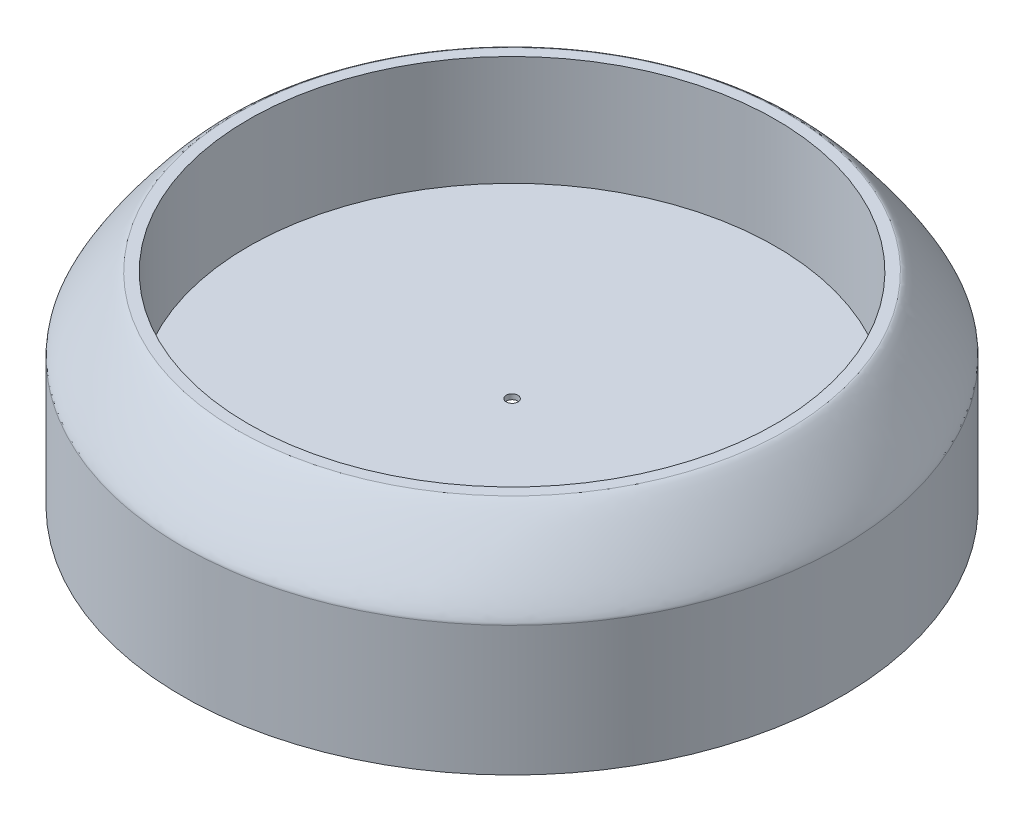
ISO-10303-21;
HEADER;
FILE_DESCRIPTION(('STEP AP214'),'2;1');
FILE_NAME('part.step','',(''),(''),'','','');
FILE_SCHEMA(('AUTOMOTIVE_DESIGN { 1 0 10303 214 1 1 1 1 }'));
ENDSEC;
DATA;
#1=APPLICATION_CONTEXT('core data for automotive mechanical design processes');
#2=APPLICATION_PROTOCOL_DEFINITION('international standard','automotive_design',2000,#1);
#3=PRODUCT_CONTEXT('',#1,'mechanical');
#4=PRODUCT('Part','Part','',(#3));
#5=PRODUCT_RELATED_PRODUCT_CATEGORY('part','',(#4));
#6=PRODUCT_DEFINITION_FORMATION('','',#4);
#7=PRODUCT_DEFINITION_CONTEXT('part definition',#1,'design');
#8=PRODUCT_DEFINITION('design','',#6,#7);
#9=PRODUCT_DEFINITION_SHAPE('','',#8);
#10=(LENGTH_UNIT() NAMED_UNIT(*) SI_UNIT(.MILLI.,.METRE.));
#11=(NAMED_UNIT(*) PLANE_ANGLE_UNIT() SI_UNIT($,.RADIAN.));
#12=(NAMED_UNIT(*) SI_UNIT($,.STERADIAN.) SOLID_ANGLE_UNIT());
#13=UNCERTAINTY_MEASURE_WITH_UNIT(LENGTH_MEASURE(1.E-05),#10,'distance_accuracy_value','');
#14=(GEOMETRIC_REPRESENTATION_CONTEXT(3) GLOBAL_UNCERTAINTY_ASSIGNED_CONTEXT((#13)) GLOBAL_UNIT_ASSIGNED_CONTEXT((#10,
#11,#12)) REPRESENTATION_CONTEXT('',''));
#15=CARTESIAN_POINT('',(0.,0.,0.));
#16=DIRECTION('',(0.,0.,1.));
#17=DIRECTION('',(1.,0.,0.));
#18=AXIS2_PLACEMENT_3D('',#15,#16,#17);
#19=CARTESIAN_POINT('',(0.,80.,0.));
#20=DIRECTION('',(0.,-1.,0.));
#21=DIRECTION('',(0.,0.,-1.));
#22=AXIS2_PLACEMENT_3D('',#19,#20,#21);
#23=CYLINDRICAL_SURFACE('',#22,90.);
#24=CARTESIAN_POINT('',(0.,60.,90.));
#25=CARTESIAN_POINT('',(11.7809724507595,60.,90.));
#26=CARTESIAN_POINT('',(23.5573095926304,60.,87.6575409000262));
#27=CARTESIAN_POINT('',(45.3257082330858,60.,78.6407749520055));
#28=CARTESIAN_POINT('',(55.3092047979656,60.,71.9700158156129));
#29=CARTESIAN_POINT('',(71.9700158156129,60.,55.3092047979656));
#30=CARTESIAN_POINT('',(78.640774952019,60.,45.3257082330533));
#31=CARTESIAN_POINT('',(87.6575409000127,60.,23.5573095926628));
#32=CARTESIAN_POINT('',(90.,60.,11.7809724506127));
#33=CARTESIAN_POINT('',(90.,60.,-11.7809724506127));
#34=CARTESIAN_POINT('',(87.6575409000227,60.,-23.5573095926388));
#35=CARTESIAN_POINT('',(78.6407749520089,60.,-45.3257082330774));
#36=CARTESIAN_POINT('',(71.9700158156117,60.,-55.3092047979669));
#37=CARTESIAN_POINT('',(55.3092047979668,60.,-71.9700158156117));
#38=CARTESIAN_POINT('',(45.3257082330825,60.,-78.6407749520068));
#39=CARTESIAN_POINT('',(23.5573095926339,60.,-87.6575409000247));
#40=CARTESIAN_POINT('',(11.7809724506127,60.,-90.));
#41=CARTESIAN_POINT('',(-11.7809724506126,60.,-90.));
#42=CARTESIAN_POINT('',(-23.5573095926336,60.,-87.6575409000248));
#43=CARTESIAN_POINT('',(-45.3257082330823,60.,-78.640774952007));
#44=CARTESIAN_POINT('',(-55.3092047979669,60.,-71.9700158156117));
#45=CARTESIAN_POINT('',(-71.9700158156117,60.,-55.3092047979668));
#46=CARTESIAN_POINT('',(-78.6407749520068,60.,-45.3257082330825));
#47=CARTESIAN_POINT('',(-87.6575409000247,60.,-23.5573095926339));
#48=CARTESIAN_POINT('',(-90.,60.,-11.7809724506125));
#49=CARTESIAN_POINT('',(-90.,60.,11.7809724506128));
#50=CARTESIAN_POINT('',(-87.6575409000127,60.,23.5573095926627));
#51=CARTESIAN_POINT('',(-78.640774952019,60.,45.3257082330532));
#52=CARTESIAN_POINT('',(-71.9700158156118,60.,55.3092047979667));
#53=CARTESIAN_POINT('',(-55.3092047979671,60.,71.9700158156115));
#54=CARTESIAN_POINT('',(-45.3257082330825,60.,78.6407749520068));
#55=CARTESIAN_POINT('',(-23.5573095926339,60.,87.6575409000247));
#56=CARTESIAN_POINT('',(-11.7809724507595,60.,90.));
#57=CARTESIAN_POINT('',(0.,60.,90.));
#58=(BOUNDED_CURVE() B_SPLINE_CURVE(3,(#24,#25,#26,#27,#28,#29,#30,#31,#32,#33,#34,#35,#36,#37,
#38,#39,#40,#41,#42,#43,#44,#45,#46,#47,#48,#49,#50,#51,#52,#53,#54,#55,#56,#57),.UNSPECIFIED.,
.T.,.F.) B_SPLINE_CURVE_WITH_KNOTS((4,2,2,2,2,2,2,2,2,2,2,2,2,2,2,2,4),(0.,0.392699081698724,
0.785398163397448,1.17809724509617,1.5707963267949,1.96349540849362,2.35619449019234,
2.74889357189107,3.14159265358979,3.53429173528852,3.92699081698724,4.31968989868597,
4.71238898038469,5.10508806208341,5.49778714378214,5.89048622548086,6.28318530717959),
.UNSPECIFIED.) CURVE() GEOMETRIC_REPRESENTATION_ITEM() RATIONAL_B_SPLINE_CURVE((1.,1.,1.,1.,1.,
1.,1.,1.,1.,1.,1.,1.,1.,1.,1.,1.,1.,1.,1.,1.,1.,1.,1.,1.,1.,1.,1.,1.,1.,1.,1.,1.,1.,1.)) REPRESENTATION_ITEM(''));
#59=CARTESIAN_POINT('',(0.,60.,90.));
#60=VERTEX_POINT('',#59);
#61=EDGE_CURVE('E12',#60,#60,#58,.F.);
#62=ORIENTED_EDGE('',*,*,#61,.T.);
#63=EDGE_LOOP('',(#62));
#64=FACE_BOUND('',#63,.T.);
#65=CARTESIAN_POINT('',(0.,24.6,0.));
#66=DIRECTION('',(0.,-1.,0.));
#67=DIRECTION('',(0.,0.,-1.));
#68=AXIS2_PLACEMENT_3D('',#65,#66,#67);
#69=CIRCLE('',#68,90.);
#70=CARTESIAN_POINT('',(0.,24.6,-90.));
#71=VERTEX_POINT('',#70);
#72=EDGE_CURVE('E103',#71,#71,#69,.T.);
#73=ORIENTED_EDGE('',*,*,#72,.F.);
#74=EDGE_LOOP('',(#73));
#75=FACE_BOUND('',#74,.T.);
#76=ADVANCED_FACE('F43',(#64,#75),#23,.T.);
#77=CARTESIAN_POINT('',(0.,80.,0.));
#78=DIRECTION('',(0.,1.,0.));
#79=DIRECTION('',(0.,0.,1.));
#80=AXIS2_PLACEMENT_3D('',#77,#78,#79);
#81=PLANE('',#80);
#82=CARTESIAN_POINT('',(0.,80.,75.));
#83=CARTESIAN_POINT('',(-9.81747704229956,80.,75.));
#84=CARTESIAN_POINT('',(-19.6310913271961,80.,73.0479507500439));
#85=CARTESIAN_POINT('',(-37.7714235275675,80.,65.533979126649));
#86=CARTESIAN_POINT('',(-46.0910039983286,80.,59.9750131796535));
#87=CARTESIAN_POINT('',(-59.9750131796538,80.,46.0910039983283));
#88=CARTESIAN_POINT('',(-65.5339791266491,80.,37.7714235275333));
#89=CARTESIAN_POINT('',(-73.047950750044,80.,19.63109132723));
#90=CARTESIAN_POINT('',(-75.,80.,9.81747704217735));
#91=CARTESIAN_POINT('',(-75.,80.,-9.81747704217711));
#92=CARTESIAN_POINT('',(-73.0479507500439,80.,-19.6310913272132));
#93=CARTESIAN_POINT('',(-65.533979126649,80.,-37.7714235275505));
#94=CARTESIAN_POINT('',(-59.9750131796537,80.,-46.0910039983284));
#95=CARTESIAN_POINT('',(-46.0910039983285,80.,-59.9750131796537));
#96=CARTESIAN_POINT('',(-37.7714235275503,80.,-65.5339791266491));
#97=CARTESIAN_POINT('',(-19.631091327213,80.,-73.047950750044));
#98=CARTESIAN_POINT('',(-9.81747704217721,80.,-75.));
#99=CARTESIAN_POINT('',(9.81747704217723,80.,-75.));
#100=CARTESIAN_POINT('',(19.6310913271961,80.,-73.0479507500439));
#101=CARTESIAN_POINT('',(37.7714235275675,80.,-65.533979126649));
#102=CARTESIAN_POINT('',(46.0910039983284,80.,-59.9750131796538));
#103=CARTESIAN_POINT('',(59.9750131796537,80.,-46.0910039983285));
#104=CARTESIAN_POINT('',(65.5339791266491,80.,-37.7714235275504));
#105=CARTESIAN_POINT('',(73.0479507500439,80.,-19.6310913272131));
#106=CARTESIAN_POINT('',(75.,80.,-9.81747704217721));
#107=CARTESIAN_POINT('',(75.,80.,9.81747704217722));
#108=CARTESIAN_POINT('',(73.0479507499759,80.,19.631091327213));
#109=CARTESIAN_POINT('',(65.5339791267172,80.,37.7714235275504));
#110=CARTESIAN_POINT('',(59.9750131796775,80.,46.0910039983047));
#111=CARTESIAN_POINT('',(46.0910039983047,80.,59.9750131796775));
#112=CARTESIAN_POINT('',(37.7714235275578,80.,65.5339791266178));
#113=CARTESIAN_POINT('',(19.6310913272057,80.,73.0479507500753));
#114=CARTESIAN_POINT('',(9.81747704229955,80.,75.));
#115=CARTESIAN_POINT('',(0.,80.,75.));
#116=(BOUNDED_CURVE() B_SPLINE_CURVE(3,(#82,#83,#84,#85,#86,#87,#88,#89,#90,#91,#92,#93,#94,#95,
#96,#97,#98,#99,#100,#101,#102,#103,#104,#105,#106,#107,#108,#109,#110,#111,#112,#113,#114,
#115),.UNSPECIFIED.,.T.,.F.) B_SPLINE_CURVE_WITH_KNOTS((4,2,2,2,2,2,2,2,2,2,2,2,2,2,2,2,4),(0.,
0.392699081698725,0.785398163397448,1.17809724509617,1.5707963267949,1.96349540849362,
2.35619449019234,2.74889357189107,3.14159265358979,3.53429173528852,3.92699081698724,
4.31968989868597,4.71238898038469,5.10508806208341,5.49778714378214,5.89048622548086,
6.28318530717959),
.UNSPECIFIED.) CURVE() GEOMETRIC_REPRESENTATION_ITEM() RATIONAL_B_SPLINE_CURVE((1.,1.,1.,1.,1.,
1.,1.,1.,1.,1.,1.,1.,1.,1.,1.,1.,1.,1.,1.,1.,1.,1.,1.,1.,1.,1.,1.,1.,1.,1.,1.,1.,1.,1.)) REPRESENTATION_ITEM(''));
#117=CARTESIAN_POINT('',(0.,80.,75.));
#118=VERTEX_POINT('',#117);
#119=EDGE_CURVE('E56',#118,#118,#116,.F.);
#120=ORIENTED_EDGE('',*,*,#119,.T.);
#121=EDGE_LOOP('',(#120));
#122=FACE_BOUND('',#121,.T.);
#123=CARTESIAN_POINT('',(0.,80.,0.));
#124=DIRECTION('',(0.,1.,0.));
#125=DIRECTION('',(0.,0.,1.));
#126=AXIS2_PLACEMENT_3D('',#123,#124,#125);
#127=CIRCLE('',#126,72.);
#128=CARTESIAN_POINT('',(0.,80.,72.));
#129=VERTEX_POINT('',#128);
#130=EDGE_CURVE('E110',#129,#129,#127,.T.);
#131=ORIENTED_EDGE('',*,*,#130,.F.);
#132=EDGE_LOOP('',(#131));
#133=FACE_BOUND('',#132,.T.);
#134=ADVANCED_FACE('F127',(#122,#133),#81,.T.);
#135=CARTESIAN_POINT('',(0.,50.,0.));
#136=DIRECTION('',(0.,1.,0.));
#137=DIRECTION('',(0.,0.,1.));
#138=AXIS2_PLACEMENT_3D('',#135,#136,#137);
#139=CYLINDRICAL_SURFACE('',#138,72.);
#140=CARTESIAN_POINT('',(0.,50.,0.));
#141=DIRECTION('',(0.,1.,0.));
#142=DIRECTION('',(0.,0.,1.));
#143=AXIS2_PLACEMENT_3D('',#140,#141,#142);
#144=CIRCLE('',#143,72.);
#145=CARTESIAN_POINT('',(0.,50.,72.));
#146=VERTEX_POINT('',#145);
#147=EDGE_CURVE('E111',#146,#146,#144,.T.);
#148=ORIENTED_EDGE('',*,*,#147,.F.);
#149=EDGE_LOOP('',(#148));
#150=FACE_BOUND('',#149,.T.);
#151=ORIENTED_EDGE('',*,*,#130,.T.);
#152=EDGE_LOOP('',(#151));
#153=FACE_BOUND('',#152,.T.);
#154=ADVANCED_FACE('F136',(#150,#153),#139,.F.);
#155=CARTESIAN_POINT('',(0.,50.,0.));
#156=DIRECTION('',(0.,1.,0.));
#157=DIRECTION('',(0.,0.,1.));
#158=AXIS2_PLACEMENT_3D('',#155,#156,#157);
#159=PLANE('',#158);
#160=CARTESIAN_POINT('',(0.,50.,0.));
#161=DIRECTION('',(0.,1.,0.));
#162=DIRECTION('',(0.,0.,1.));
#163=AXIS2_PLACEMENT_3D('',#160,#161,#162);
#164=CIRCLE('',#163,1.6);
#165=CARTESIAN_POINT('',(0.,50.,1.6));
#166=VERTEX_POINT('',#165);
#167=EDGE_CURVE('E201',#166,#166,#164,.T.);
#168=ORIENTED_EDGE('',*,*,#167,.F.);
#169=EDGE_LOOP('',(#168));
#170=FACE_BOUND('',#169,.T.);
#171=ORIENTED_EDGE('',*,*,#147,.T.);
#172=EDGE_LOOP('',(#171));
#173=FACE_BOUND('',#172,.T.);
#174=ADVANCED_FACE('F175',(#170,#173),#159,.T.);
#175=CARTESIAN_POINT('',(0.,24.6,0.));
#176=DIRECTION('',(0.,-1.,0.));
#177=DIRECTION('',(0.,0.,-1.));
#178=AXIS2_PLACEMENT_3D('',#175,#176,#177);
#179=PLANE('',#178);
#180=CARTESIAN_POINT('',(86.,24.6,0.));
#181=DIRECTION('',(0.,-1.,0.));
#182=DIRECTION('',(0.,0.,-1.));
#183=AXIS2_PLACEMENT_3D('',#180,#181,#182);
#184=CIRCLE('',#183,2.5);
#185=CARTESIAN_POINT('',(86.,24.6,-2.5));
#186=VERTEX_POINT('',#185);
#187=EDGE_CURVE('E80',#186,#186,#184,.T.);
#188=ORIENTED_EDGE('',*,*,#187,.F.);
#189=EDGE_LOOP('',(#188));
#190=FACE_BOUND('',#189,.T.);
#191=CARTESIAN_POINT('',(0.,24.6,86.));
#192=DIRECTION('',(0.,-1.,0.));
#193=DIRECTION('',(0.,0.,-1.));
#194=AXIS2_PLACEMENT_3D('',#191,#192,#193);
#195=CIRCLE('',#194,2.5);
#196=CARTESIAN_POINT('',(0.,24.6,83.5));
#197=VERTEX_POINT('',#196);
#198=EDGE_CURVE('E79',#197,#197,#195,.T.);
#199=ORIENTED_EDGE('',*,*,#198,.F.);
#200=EDGE_LOOP('',(#199));
#201=FACE_BOUND('',#200,.T.);
#202=CARTESIAN_POINT('',(-86.,24.6,0.));
#203=DIRECTION('',(0.,-1.,0.));
#204=DIRECTION('',(0.,0.,-1.));
#205=AXIS2_PLACEMENT_3D('',#202,#203,#204);
#206=CIRCLE('',#205,2.5);
#207=CARTESIAN_POINT('',(-86.,24.6,-2.5));
#208=VERTEX_POINT('',#207);
#209=EDGE_CURVE('E91',#208,#208,#206,.T.);
#210=ORIENTED_EDGE('',*,*,#209,.F.);
#211=EDGE_LOOP('',(#210));
#212=FACE_BOUND('',#211,.T.);
#213=CARTESIAN_POINT('',(0.,24.6,-86.));
#214=DIRECTION('',(0.,-1.,0.));
#215=DIRECTION('',(0.,0.,-1.));
#216=AXIS2_PLACEMENT_3D('',#213,#214,#215);
#217=CIRCLE('',#216,2.5);
#218=CARTESIAN_POINT('',(0.,24.6,-88.5));
#219=VERTEX_POINT('',#218);
#220=EDGE_CURVE('E97',#219,#219,#217,.T.);
#221=ORIENTED_EDGE('',*,*,#220,.F.);
#222=EDGE_LOOP('',(#221));
#223=FACE_BOUND('',#222,.T.);
#224=ORIENTED_EDGE('',*,*,#72,.T.);
#225=EDGE_LOOP('',(#224));
#226=FACE_BOUND('',#225,.T.);
#227=CARTESIAN_POINT('',(0.,24.6,0.));
#228=DIRECTION('',(0.,-1.,0.));
#229=DIRECTION('',(0.,0.,-1.));
#230=AXIS2_PLACEMENT_3D('',#227,#228,#229);
#231=CIRCLE('',#230,81.);
#232=CARTESIAN_POINT('',(0.,24.6,-81.));
#233=VERTEX_POINT('',#232);
#234=EDGE_CURVE('E106',#233,#233,#231,.F.);
#235=ORIENTED_EDGE('',*,*,#234,.T.);
#236=EDGE_LOOP('',(#235));
#237=FACE_BOUND('',#236,.T.);
#238=ADVANCED_FACE('F171',(#190,#201,#212,#223,#226,#237),#179,.T.);
#239=CARTESIAN_POINT('',(0.,48.6,0.));
#240=DIRECTION('',(0.,-1.,0.));
#241=DIRECTION('',(0.,0.,-1.));
#242=AXIS2_PLACEMENT_3D('',#239,#240,#241);
#243=PLANE('',#242);
#244=CARTESIAN_POINT('',(76.,48.6,0.));
#245=DIRECTION('',(0.,-1.,0.));
#246=DIRECTION('',(0.,0.,-1.));
#247=AXIS2_PLACEMENT_3D('',#244,#245,#246);
#248=CIRCLE('',#247,2.);
#249=CARTESIAN_POINT('',(76.,48.6,-2.));
#250=VERTEX_POINT('',#249);
#251=EDGE_CURVE('E210',#250,#250,#248,.T.);
#252=ORIENTED_EDGE('',*,*,#251,.F.);
#253=EDGE_LOOP('',(#252));
#254=FACE_BOUND('',#253,.T.);
#255=CARTESIAN_POINT('',(-76.,48.6,0.));
#256=DIRECTION('',(0.,-1.,0.));
#257=DIRECTION('',(0.,0.,-1.));
#258=AXIS2_PLACEMENT_3D('',#255,#256,#257);
#259=CIRCLE('',#258,2.);
#260=CARTESIAN_POINT('',(-76.,48.6,-2.));
#261=VERTEX_POINT('',#260);
#262=EDGE_CURVE('E219',#261,#261,#259,.T.);
#263=ORIENTED_EDGE('',*,*,#262,.F.);
#264=EDGE_LOOP('',(#263));
#265=FACE_BOUND('',#264,.T.);
#266=CARTESIAN_POINT('',(0.,48.6,76.));
#267=DIRECTION('',(0.,-1.,0.));
#268=DIRECTION('',(0.,0.,-1.));
#269=AXIS2_PLACEMENT_3D('',#266,#267,#268);
#270=CIRCLE('',#269,2.);
#271=CARTESIAN_POINT('',(0.,48.6,74.));
#272=VERTEX_POINT('',#271);
#273=EDGE_CURVE('E213',#272,#272,#270,.T.);
#274=ORIENTED_EDGE('',*,*,#273,.F.);
#275=EDGE_LOOP('',(#274));
#276=FACE_BOUND('',#275,.T.);
#277=CARTESIAN_POINT('',(0.,48.6,0.));
#278=DIRECTION('',(0.,-1.,0.));
#279=DIRECTION('',(0.,0.,-1.));
#280=AXIS2_PLACEMENT_3D('',#277,#278,#279);
#281=CIRCLE('',#280,1.6);
#282=CARTESIAN_POINT('',(0.,48.6,-1.6));
#283=VERTEX_POINT('',#282);
#284=EDGE_CURVE('E51',#283,#283,#281,.T.);
#285=ORIENTED_EDGE('',*,*,#284,.F.);
#286=EDGE_LOOP('',(#285));
#287=FACE_BOUND('',#286,.T.);
#288=CARTESIAN_POINT('',(0.,48.6,0.));
#289=DIRECTION('',(0.,-1.,0.));
#290=DIRECTION('',(0.,0.,-1.));
#291=AXIS2_PLACEMENT_3D('',#288,#289,#290);
#292=CIRCLE('',#291,81.);
#293=CARTESIAN_POINT('',(0.,48.6,-81.));
#294=VERTEX_POINT('',#293);
#295=EDGE_CURVE('E107',#294,#294,#292,.T.);
#296=ORIENTED_EDGE('',*,*,#295,.T.);
#297=EDGE_LOOP('',(#296));
#298=FACE_BOUND('',#297,.T.);
#299=ADVANCED_FACE('F174',(#254,#265,#276,#287,#298),#243,.T.);
#300=CARTESIAN_POINT('',(0.,48.6,0.));
#301=DIRECTION('',(0.,-1.,0.));
#302=DIRECTION('',(0.,0.,-1.));
#303=AXIS2_PLACEMENT_3D('',#300,#301,#302);
#304=CYLINDRICAL_SURFACE('',#303,81.);
#305=ORIENTED_EDGE('',*,*,#295,.F.);
#306=EDGE_LOOP('',(#305));
#307=FACE_BOUND('',#306,.T.);
#308=ORIENTED_EDGE('',*,*,#234,.F.);
#309=EDGE_LOOP('',(#308));
#310=FACE_BOUND('',#309,.T.);
#311=ADVANCED_FACE('F180',(#307,#310),#304,.F.);
#312=CARTESIAN_POINT('',(0.,80.,75.));
#313=CARTESIAN_POINT('',(9.81747704229955,80.,75.));
#314=CARTESIAN_POINT('',(19.6310913272057,80.,73.0479507500753));
#315=CARTESIAN_POINT('',(37.7714235275578,80.,65.5339791266178));
#316=CARTESIAN_POINT('',(46.0910039983047,80.,59.9750131796775));
#317=CARTESIAN_POINT('',(59.9750131796775,80.,46.0910039983047));
#318=CARTESIAN_POINT('',(65.5339791267172,80.,37.7714235275504));
#319=CARTESIAN_POINT('',(73.0479507499759,80.,19.631091327213));
#320=CARTESIAN_POINT('',(75.,80.,9.81747704217722));
#321=CARTESIAN_POINT('',(75.,80.,-9.81747704217721));
#322=CARTESIAN_POINT('',(73.0479507500439,80.,-19.6310913272131));
#323=CARTESIAN_POINT('',(65.5339791266491,80.,-37.7714235275504));
#324=CARTESIAN_POINT('',(59.9750131796537,80.,-46.0910039983285));
#325=CARTESIAN_POINT('',(46.0910039983284,80.,-59.9750131796538));
#326=CARTESIAN_POINT('',(37.7714235275675,80.,-65.533979126649));
#327=CARTESIAN_POINT('',(19.6310913271961,80.,-73.0479507500439));
#328=CARTESIAN_POINT('',(9.81747704217723,80.,-75.));
#329=CARTESIAN_POINT('',(-9.81747704217721,80.,-75.));
#330=CARTESIAN_POINT('',(-19.631091327213,80.,-73.047950750044));
#331=CARTESIAN_POINT('',(-37.7714235275503,80.,-65.5339791266491));
#332=CARTESIAN_POINT('',(-46.0910039983285,80.,-59.9750131796537));
#333=CARTESIAN_POINT('',(-59.9750131796537,80.,-46.0910039983284));
#334=CARTESIAN_POINT('',(-65.533979126649,80.,-37.7714235275505));
#335=CARTESIAN_POINT('',(-73.0479507500439,80.,-19.6310913272132));
#336=CARTESIAN_POINT('',(-75.,80.,-9.81747704217711));
#337=CARTESIAN_POINT('',(-75.,80.,9.81747704217735));
#338=CARTESIAN_POINT('',(-73.047950750044,80.,19.63109132723));
#339=CARTESIAN_POINT('',(-65.5339791266491,80.,37.7714235275333));
#340=CARTESIAN_POINT('',(-59.9750131796538,80.,46.0910039983283));
#341=CARTESIAN_POINT('',(-46.0910039983286,80.,59.9750131796535));
#342=CARTESIAN_POINT('',(-37.7714235275675,80.,65.533979126649));
#343=CARTESIAN_POINT('',(-19.6310913271961,80.,73.0479507500439));
#344=CARTESIAN_POINT('',(-9.81747704229956,80.,75.));
#345=CARTESIAN_POINT('',(0.,80.,75.));
#346=CARTESIAN_POINT('',(0.,80.,90.));
#347=CARTESIAN_POINT('',(11.7809724507595,80.,90.));
#348=CARTESIAN_POINT('',(23.5573095926059,80.,87.6575409000494));
#349=CARTESIAN_POINT('',(45.3257082331102,80.,78.6407749519822));
#350=CARTESIAN_POINT('',(55.3092047979656,80.,71.9700158156129));
#351=CARTESIAN_POINT('',(71.9700158156129,80.,55.3092047979656));
#352=CARTESIAN_POINT('',(78.6407749520198,80.0000000000681,45.3257082330536));
#353=CARTESIAN_POINT('',(87.6575409000119,79.9999999999319,23.5573095926625));
#354=CARTESIAN_POINT('',(90.,80.,11.7809724506127));
#355=CARTESIAN_POINT('',(90.,80.,-11.7809724506127));
#356=CARTESIAN_POINT('',(87.65754090008,80.,-23.5573095926625));
#357=CARTESIAN_POINT('',(78.6407749519516,80.,-45.3257082330537));
#358=CARTESIAN_POINT('',(71.9700158156117,80.,-55.3092047979669));
#359=CARTESIAN_POINT('',(55.3092047979668,80.,-71.9700158156118));
#360=CARTESIAN_POINT('',(45.3257082330879,80.,-78.6407749520197));
#361=CARTESIAN_POINT('',(23.5573095926286,80.,-87.6575409000119));
#362=CARTESIAN_POINT('',(11.7809724506127,80.,-90.));
#363=CARTESIAN_POINT('',(-11.7809724506126,80.,-90.));
#364=CARTESIAN_POINT('',(-23.5573095926283,80.,-87.6575409000119));
#365=CARTESIAN_POINT('',(-45.3257082330876,80.,-78.6407749520198));
#366=CARTESIAN_POINT('',(-55.3092047979669,80.,-71.9700158156117));
#367=CARTESIAN_POINT('',(-71.9700158156117,80.,-55.3092047979668));
#368=CARTESIAN_POINT('',(-78.6407749520197,80.,-45.3257082330878));
#369=CARTESIAN_POINT('',(-87.6575409000119,80.,-23.5573095926285));
#370=CARTESIAN_POINT('',(-90.,80.,-11.7809724506125));
#371=CARTESIAN_POINT('',(-90.,80.,11.7809724506128));
#372=CARTESIAN_POINT('',(-87.6575409000119,80.0000000000681,23.5573095926624));
#373=CARTESIAN_POINT('',(-78.6407749520198,79.9999999999319,45.3257082330535));
#374=CARTESIAN_POINT('',(-71.9700158156119,80.,55.3092047979667));
#375=CARTESIAN_POINT('',(-55.3092047979671,80.,71.9700158156115));
#376=CARTESIAN_POINT('',(-45.3257082330879,80.,78.6407749520197));
#377=CARTESIAN_POINT('',(-23.5573095926286,80.,87.6575409000118));
#378=CARTESIAN_POINT('',(-11.7809724507595,80.,90.));
#379=CARTESIAN_POINT('',(0.,80.,90.));
#380=CARTESIAN_POINT('',(0.,60.,90.));
#381=CARTESIAN_POINT('',(11.7809724507595,60.,90.));
#382=CARTESIAN_POINT('',(23.5573095926304,60.,87.6575409000262));
#383=CARTESIAN_POINT('',(45.3257082330858,60.,78.6407749520055));
#384=CARTESIAN_POINT('',(55.3092047979656,60.,71.9700158156129));
#385=CARTESIAN_POINT('',(71.9700158156129,60.,55.3092047979656));
#386=CARTESIAN_POINT('',(78.640774952019,60.,45.3257082330533));
#387=CARTESIAN_POINT('',(87.6575409000127,60.,23.5573095926628));
#388=CARTESIAN_POINT('',(90.,60.,11.7809724506127));
#389=CARTESIAN_POINT('',(90.,60.,-11.7809724506127));
#390=CARTESIAN_POINT('',(87.6575409000227,60.,-23.5573095926388));
#391=CARTESIAN_POINT('',(78.6407749520089,60.,-45.3257082330774));
#392=CARTESIAN_POINT('',(71.9700158156117,60.,-55.3092047979669));
#393=CARTESIAN_POINT('',(55.3092047979668,60.,-71.9700158156117));
#394=CARTESIAN_POINT('',(45.3257082330825,60.,-78.6407749520068));
#395=CARTESIAN_POINT('',(23.5573095926339,60.,-87.6575409000247));
#396=CARTESIAN_POINT('',(11.7809724506127,60.,-90.));
#397=CARTESIAN_POINT('',(-11.7809724506126,60.,-90.));
#398=CARTESIAN_POINT('',(-23.5573095926336,60.,-87.6575409000248));
#399=CARTESIAN_POINT('',(-45.3257082330823,60.,-78.640774952007));
#400=CARTESIAN_POINT('',(-55.3092047979669,60.,-71.9700158156117));
#401=CARTESIAN_POINT('',(-71.9700158156117,60.,-55.3092047979668));
#402=CARTESIAN_POINT('',(-78.6407749520068,60.,-45.3257082330825));
#403=CARTESIAN_POINT('',(-87.6575409000247,60.,-23.5573095926339));
#404=CARTESIAN_POINT('',(-90.,60.,-11.7809724506125));
#405=CARTESIAN_POINT('',(-90.,60.,11.7809724506128));
#406=CARTESIAN_POINT('',(-87.6575409000127,60.,23.5573095926627));
#407=CARTESIAN_POINT('',(-78.640774952019,60.,45.3257082330532));
#408=CARTESIAN_POINT('',(-71.9700158156118,60.,55.3092047979667));
#409=CARTESIAN_POINT('',(-55.3092047979671,60.,71.9700158156115));
#410=CARTESIAN_POINT('',(-45.3257082330825,60.,78.6407749520068));
#411=CARTESIAN_POINT('',(-23.5573095926339,60.,87.6575409000247));
#412=CARTESIAN_POINT('',(-11.7809724507595,60.,90.));
#413=CARTESIAN_POINT('',(0.,60.,90.));
#414=(BOUNDED_SURFACE() B_SPLINE_SURFACE(2,3,((#312,#313,#314,#315,#316,#317,#318,#319,#320,
#321,#322,#323,#324,#325,#326,#327,#328,#329,#330,#331,#332,#333,#334,#335,#336,#337,#338,#339,
#340,#341,#342,#343,#344,#345),(#346,#347,#348,#349,#350,#351,#352,#353,#354,#355,#356,#357,
#358,#359,#360,#361,#362,#363,#364,#365,#366,#367,#368,#369,#370,#371,#372,#373,#374,#375,#376,
#377,#378,#379),(#380,#381,#382,#383,#384,#385,#386,#387,#388,#389,#390,#391,#392,#393,#394,
#395,#396,#397,#398,#399,#400,#401,#402,#403,#404,#405,#406,#407,#408,#409,#410,#411,#412,
#413)),.UNSPECIFIED.,.F.,.T.,.F.) B_SPLINE_SURFACE_WITH_KNOTS((3,3),(4,2,2,2,2,2,2,2,2,2,2,2,2,
2,2,2,4),(0.,1.),(0.,0.392699081698724,0.785398163397448,1.17809724509617,1.5707963267949,
1.96349540849362,2.35619449019234,2.74889357189107,3.14159265358979,3.53429173528852,
3.92699081698724,4.31968989868597,4.71238898038469,5.10508806208341,5.49778714378214,
5.89048622548086,6.28318530717959),
.UNSPECIFIED.) GEOMETRIC_REPRESENTATION_ITEM() RATIONAL_B_SPLINE_SURFACE(((1.,1.,1.,1.,1.,1.,1.,
1.,1.,1.,1.,1.,1.,1.,1.,1.,1.,1.,1.,1.,1.,1.,1.,1.,1.,1.,1.,1.,1.,1.,1.,1.,1.,1.),
(0.111111111111111,0.111111111111111,0.111111111111111,0.111111111111111,0.111111111111111,
0.111111111111111,0.111111111111111,0.111111111111111,0.111111111111111,0.111111111111111,
0.111111111111111,0.111111111111111,0.111111111111111,0.111111111111111,0.111111111111111,
0.111111111111111,0.111111111111111,0.111111111111111,0.111111111111111,0.111111111111111,
0.111111111111111,0.111111111111111,0.111111111111111,0.111111111111111,0.111111111111111,
0.111111111111111,0.111111111111111,0.111111111111111,0.111111111111111,0.111111111111111,
0.111111111111111,0.111111111111111,0.111111111111111,0.111111111111111),(1.,1.,1.,1.,1.,1.,1.,
1.,1.,1.,1.,1.,1.,1.,1.,1.,1.,1.,1.,1.,1.,1.,1.,1.,1.,1.,1.,1.,1.,1.,1.,1.,1.,1.))) REPRESENTATION_ITEM('') SURFACE());
#415=ORIENTED_EDGE('',*,*,#61,.F.);
#416=EDGE_LOOP('',(#415));
#417=FACE_BOUND('',#416,.T.);
#418=ORIENTED_EDGE('',*,*,#119,.F.);
#419=EDGE_LOOP('',(#418));
#420=FACE_BOUND('',#419,.T.);
#421=ADVANCED_FACE('F46',(#417,#420),#414,.T.);
#422=CARTESIAN_POINT('',(0.,32.6,-86.));
#423=DIRECTION('',(0.,-1.,0.));
#424=DIRECTION('',(0.,0.,-1.));
#425=AXIS2_PLACEMENT_3D('',#422,#423,#424);
#426=CONICAL_SURFACE('',#425,2.5,1.02974425867665);
#427=CARTESIAN_POINT('',(0.,34.1021515475689,-86.));
#428=VERTEX_POINT('',#427);
#429=VERTEX_LOOP('',#428);
#430=FACE_BOUND('',#429,.T.);
#431=CARTESIAN_POINT('',(0.,32.6,-86.));
#432=DIRECTION('',(0.,-1.,0.));
#433=DIRECTION('',(0.,0.,-1.));
#434=AXIS2_PLACEMENT_3D('',#431,#432,#433);
#435=CIRCLE('',#434,2.5);
#436=CARTESIAN_POINT('',(0.,32.6,-88.5));
#437=VERTEX_POINT('',#436);
#438=EDGE_CURVE('E100',#437,#437,#435,.T.);
#439=ORIENTED_EDGE('',*,*,#438,.T.);
#440=EDGE_LOOP('',(#439));
#441=FACE_BOUND('',#440,.T.);
#442=ADVANCED_FACE('F188',(#430,#441),#426,.F.);
#443=CARTESIAN_POINT('',(0.,24.6,-86.));
#444=DIRECTION('',(0.,-1.,0.));
#445=DIRECTION('',(0.,0.,-1.));
#446=AXIS2_PLACEMENT_3D('',#443,#444,#445);
#447=CYLINDRICAL_SURFACE('',#446,2.5);
#448=ORIENTED_EDGE('',*,*,#438,.F.);
#449=EDGE_LOOP('',(#448));
#450=FACE_BOUND('',#449,.T.);
#451=ORIENTED_EDGE('',*,*,#220,.T.);
#452=EDGE_LOOP('',(#451));
#453=FACE_BOUND('',#452,.T.);
#454=ADVANCED_FACE('F265',(#450,#453),#447,.F.);
#455=CARTESIAN_POINT('',(-86.,32.6,0.));
#456=DIRECTION('',(0.,-1.,0.));
#457=DIRECTION('',(0.,0.,-1.));
#458=AXIS2_PLACEMENT_3D('',#455,#456,#457);
#459=CONICAL_SURFACE('',#458,2.5,1.02974425867666);
#460=CARTESIAN_POINT('',(-86.,34.1021515475689,0.));
#461=VERTEX_POINT('',#460);
#462=VERTEX_LOOP('',#461);
#463=FACE_BOUND('',#462,.T.);
#464=CARTESIAN_POINT('',(-86.,32.6,0.));
#465=DIRECTION('',(0.,-1.,0.));
#466=DIRECTION('',(0.,0.,-1.));
#467=AXIS2_PLACEMENT_3D('',#464,#465,#466);
#468=CIRCLE('',#467,2.5);
#469=CARTESIAN_POINT('',(-86.,32.6,-2.5));
#470=VERTEX_POINT('',#469);
#471=EDGE_CURVE('E94',#470,#470,#468,.T.);
#472=ORIENTED_EDGE('',*,*,#471,.T.);
#473=EDGE_LOOP('',(#472));
#474=FACE_BOUND('',#473,.T.);
#475=ADVANCED_FACE('F261',(#463,#474),#459,.F.);
#476=CARTESIAN_POINT('',(-86.,24.6,0.));
#477=DIRECTION('',(0.,-1.,0.));
#478=DIRECTION('',(0.,0.,-1.));
#479=AXIS2_PLACEMENT_3D('',#476,#477,#478);
#480=CYLINDRICAL_SURFACE('',#479,2.5);
#481=ORIENTED_EDGE('',*,*,#471,.F.);
#482=EDGE_LOOP('',(#481));
#483=FACE_BOUND('',#482,.T.);
#484=ORIENTED_EDGE('',*,*,#209,.T.);
#485=EDGE_LOOP('',(#484));
#486=FACE_BOUND('',#485,.T.);
#487=ADVANCED_FACE('F257',(#483,#486),#480,.F.);
#488=CARTESIAN_POINT('',(0.,32.6,86.));
#489=DIRECTION('',(0.,-1.,0.));
#490=DIRECTION('',(0.,0.,-1.));
#491=AXIS2_PLACEMENT_3D('',#488,#489,#490);
#492=CONICAL_SURFACE('',#491,2.5,1.02974425867665);
#493=CARTESIAN_POINT('',(0.,34.1021515475689,86.));
#494=VERTEX_POINT('',#493);
#495=VERTEX_LOOP('',#494);
#496=FACE_BOUND('',#495,.T.);
#497=CARTESIAN_POINT('',(0.,32.6,86.));
#498=DIRECTION('',(0.,-1.,0.));
#499=DIRECTION('',(0.,0.,-1.));
#500=AXIS2_PLACEMENT_3D('',#497,#498,#499);
#501=CIRCLE('',#500,2.5);
#502=CARTESIAN_POINT('',(0.,32.6,83.5));
#503=VERTEX_POINT('',#502);
#504=EDGE_CURVE('E83',#503,#503,#501,.T.);
#505=ORIENTED_EDGE('',*,*,#504,.T.);
#506=EDGE_LOOP('',(#505));
#507=FACE_BOUND('',#506,.T.);
#508=ADVANCED_FACE('F253',(#496,#507),#492,.F.);
#509=CARTESIAN_POINT('',(0.,24.6,86.));
#510=DIRECTION('',(0.,-1.,0.));
#511=DIRECTION('',(0.,0.,-1.));
#512=AXIS2_PLACEMENT_3D('',#509,#510,#511);
#513=CYLINDRICAL_SURFACE('',#512,2.5);
#514=ORIENTED_EDGE('',*,*,#504,.F.);
#515=EDGE_LOOP('',(#514));
#516=FACE_BOUND('',#515,.T.);
#517=ORIENTED_EDGE('',*,*,#198,.T.);
#518=EDGE_LOOP('',(#517));
#519=FACE_BOUND('',#518,.T.);
#520=ADVANCED_FACE('F73',(#516,#519),#513,.F.);
#521=CARTESIAN_POINT('',(86.,32.6,0.));
#522=DIRECTION('',(0.,-1.,0.));
#523=DIRECTION('',(0.,0.,-1.));
#524=AXIS2_PLACEMENT_3D('',#521,#522,#523);
#525=CONICAL_SURFACE('',#524,2.5,1.02974425867666);
#526=CARTESIAN_POINT('',(86.,34.1021515475689,0.));
#527=VERTEX_POINT('',#526);
#528=VERTEX_LOOP('',#527);
#529=FACE_BOUND('',#528,.T.);
#530=CARTESIAN_POINT('',(86.,32.6,0.));
#531=DIRECTION('',(0.,-1.,0.));
#532=DIRECTION('',(0.,0.,-1.));
#533=AXIS2_PLACEMENT_3D('',#530,#531,#532);
#534=CIRCLE('',#533,2.5);
#535=CARTESIAN_POINT('',(86.,32.6,-2.5));
#536=VERTEX_POINT('',#535);
#537=EDGE_CURVE('E77',#536,#536,#534,.T.);
#538=ORIENTED_EDGE('',*,*,#537,.T.);
#539=EDGE_LOOP('',(#538));
#540=FACE_BOUND('',#539,.T.);
#541=ADVANCED_FACE('F69',(#529,#540),#525,.F.);
#542=CARTESIAN_POINT('',(86.,24.6,0.));
#543=DIRECTION('',(0.,-1.,0.));
#544=DIRECTION('',(0.,0.,-1.));
#545=AXIS2_PLACEMENT_3D('',#542,#543,#544);
#546=CYLINDRICAL_SURFACE('',#545,2.5);
#547=ORIENTED_EDGE('',*,*,#537,.F.);
#548=EDGE_LOOP('',(#547));
#549=FACE_BOUND('',#548,.T.);
#550=ORIENTED_EDGE('',*,*,#187,.T.);
#551=EDGE_LOOP('',(#550));
#552=FACE_BOUND('',#551,.T.);
#553=ADVANCED_FACE('F72',(#549,#552),#546,.F.);
#554=CARTESIAN_POINT('',(0.,48.,0.));
#555=DIRECTION('',(0.,1.,0.));
#556=DIRECTION('',(0.,0.,1.));
#557=AXIS2_PLACEMENT_3D('',#554,#555,#556);
#558=CYLINDRICAL_SURFACE('',#557,1.6);
#559=ORIENTED_EDGE('',*,*,#284,.T.);
#560=EDGE_LOOP('',(#559));
#561=FACE_BOUND('',#560,.T.);
#562=ORIENTED_EDGE('',*,*,#167,.T.);
#563=EDGE_LOOP('',(#562));
#564=FACE_BOUND('',#563,.T.);
#565=ADVANCED_FACE('F237',(#561,#564),#558,.F.);
#566=CARTESIAN_POINT('',(0.,54.6,76.));
#567=DIRECTION('',(0.,-1.,0.));
#568=DIRECTION('',(0.,0.,-1.));
#569=AXIS2_PLACEMENT_3D('',#566,#567,#568);
#570=CYLINDRICAL_SURFACE('',#569,2.);
#571=CARTESIAN_POINT('',(0.,54.6,76.));
#572=DIRECTION('',(0.,-1.,0.));
#573=DIRECTION('',(0.,0.,-1.));
#574=AXIS2_PLACEMENT_3D('',#571,#572,#573);
#575=CIRCLE('',#574,2.);
#576=CARTESIAN_POINT('',(0.,54.6,74.));
#577=VERTEX_POINT('',#576);
#578=EDGE_CURVE('E216',#577,#577,#575,.T.);
#579=ORIENTED_EDGE('',*,*,#578,.F.);
#580=EDGE_LOOP('',(#579));
#581=FACE_BOUND('',#580,.T.);
#582=ORIENTED_EDGE('',*,*,#273,.T.);
#583=EDGE_LOOP('',(#582));
#584=FACE_BOUND('',#583,.T.);
#585=ADVANCED_FACE('F239',(#581,#584),#570,.F.);
#586=CARTESIAN_POINT('',(0.,54.6,76.));
#587=DIRECTION('',(0.,-1.,0.));
#588=DIRECTION('',(0.,0.,-1.));
#589=AXIS2_PLACEMENT_3D('',#586,#587,#588);
#590=PLANE('',#589);
#591=ORIENTED_EDGE('',*,*,#578,.T.);
#592=EDGE_LOOP('',(#591));
#593=FACE_BOUND('',#592,.T.);
#594=ADVANCED_FACE('F245',(#593),#590,.T.);
#595=CARTESIAN_POINT('',(-76.,54.6,0.));
#596=DIRECTION('',(0.,-1.,0.));
#597=DIRECTION('',(0.,0.,-1.));
#598=AXIS2_PLACEMENT_3D('',#595,#596,#597);
#599=CYLINDRICAL_SURFACE('',#598,2.);
#600=CARTESIAN_POINT('',(-76.,54.6,0.));
#601=DIRECTION('',(0.,-1.,0.));
#602=DIRECTION('',(0.,0.,-1.));
#603=AXIS2_PLACEMENT_3D('',#600,#601,#602);
#604=CIRCLE('',#603,2.);
#605=CARTESIAN_POINT('',(-76.,54.6,-2.));
#606=VERTEX_POINT('',#605);
#607=EDGE_CURVE('E222',#606,#606,#604,.T.);
#608=ORIENTED_EDGE('',*,*,#607,.F.);
#609=EDGE_LOOP('',(#608));
#610=FACE_BOUND('',#609,.T.);
#611=ORIENTED_EDGE('',*,*,#262,.T.);
#612=EDGE_LOOP('',(#611));
#613=FACE_BOUND('',#612,.T.);
#614=ADVANCED_FACE('F339',(#610,#613),#599,.F.);
#615=CARTESIAN_POINT('',(-76.,54.6,0.));
#616=DIRECTION('',(0.,-1.,0.));
#617=DIRECTION('',(0.,0.,-1.));
#618=AXIS2_PLACEMENT_3D('',#615,#616,#617);
#619=PLANE('',#618);
#620=ORIENTED_EDGE('',*,*,#607,.T.);
#621=EDGE_LOOP('',(#620));
#622=FACE_BOUND('',#621,.T.);
#623=ADVANCED_FACE('F348',(#622),#619,.T.);
#624=CARTESIAN_POINT('',(76.,54.6,0.));
#625=DIRECTION('',(0.,-1.,0.));
#626=DIRECTION('',(0.,0.,-1.));
#627=AXIS2_PLACEMENT_3D('',#624,#625,#626);
#628=CYLINDRICAL_SURFACE('',#627,2.);
#629=CARTESIAN_POINT('',(76.,54.6,0.));
#630=DIRECTION('',(0.,-1.,0.));
#631=DIRECTION('',(0.,0.,-1.));
#632=AXIS2_PLACEMENT_3D('',#629,#630,#631);
#633=CIRCLE('',#632,2.);
#634=CARTESIAN_POINT('',(76.,54.6,-2.));
#635=VERTEX_POINT('',#634);
#636=EDGE_CURVE('E207',#635,#635,#633,.T.);
#637=ORIENTED_EDGE('',*,*,#636,.F.);
#638=EDGE_LOOP('',(#637));
#639=FACE_BOUND('',#638,.T.);
#640=ORIENTED_EDGE('',*,*,#251,.T.);
#641=EDGE_LOOP('',(#640));
#642=FACE_BOUND('',#641,.T.);
#643=ADVANCED_FACE('F228',(#639,#642),#628,.F.);
#644=CARTESIAN_POINT('',(76.,54.6,0.));
#645=DIRECTION('',(0.,-1.,0.));
#646=DIRECTION('',(0.,0.,-1.));
#647=AXIS2_PLACEMENT_3D('',#644,#645,#646);
#648=PLANE('',#647);
#649=ORIENTED_EDGE('',*,*,#636,.T.);
#650=EDGE_LOOP('',(#649));
#651=FACE_BOUND('',#650,.T.);
#652=ADVANCED_FACE('F367',(#651),#648,.T.);
#653=CLOSED_SHELL('',(#76,#134,#154,#174,#238,#299,#311,#421,#442,#454,#475,#487,#508,#520,#541,
#553,#565,#585,#594,#614,#623,#643,#652));
#654=MANIFOLD_SOLID_BREP('B2',#653);
#655=ADVANCED_BREP_SHAPE_REPRESENTATION('',(#18,#654),#14);
#656=SHAPE_DEFINITION_REPRESENTATION(#9,#655);
ENDSEC;
END-ISO-10303-21;
